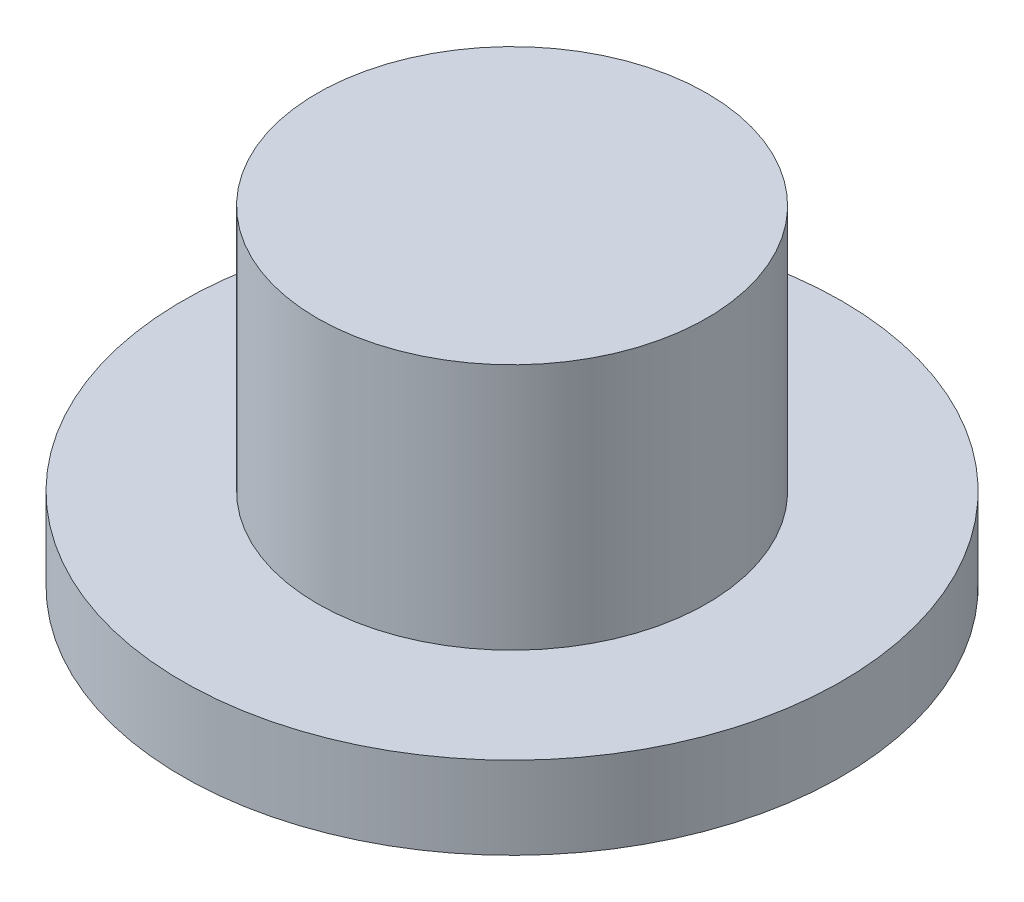
ISO-10303-21;
HEADER;
FILE_DESCRIPTION(('STEP AP214'),'2;1');
FILE_NAME('part.step','',(''),(''),'','','');
FILE_SCHEMA(('AUTOMOTIVE_DESIGN { 1 0 10303 214 1 1 1 1 }'));
ENDSEC;
DATA;
#1=APPLICATION_CONTEXT('core data for automotive mechanical design processes');
#2=APPLICATION_PROTOCOL_DEFINITION('international standard','automotive_design',2000,#1);
#3=PRODUCT_CONTEXT('',#1,'mechanical');
#4=PRODUCT('Part','Part','',(#3));
#5=PRODUCT_RELATED_PRODUCT_CATEGORY('part','',(#4));
#6=PRODUCT_DEFINITION_FORMATION('','',#4);
#7=PRODUCT_DEFINITION_CONTEXT('part definition',#1,'design');
#8=PRODUCT_DEFINITION('design','',#6,#7);
#9=PRODUCT_DEFINITION_SHAPE('','',#8);
#10=(LENGTH_UNIT() NAMED_UNIT(*) SI_UNIT(.MILLI.,.METRE.));
#11=(NAMED_UNIT(*) PLANE_ANGLE_UNIT() SI_UNIT($,.RADIAN.));
#12=(NAMED_UNIT(*) SI_UNIT($,.STERADIAN.) SOLID_ANGLE_UNIT());
#13=UNCERTAINTY_MEASURE_WITH_UNIT(LENGTH_MEASURE(1.E-05),#10,'distance_accuracy_value','');
#14=(GEOMETRIC_REPRESENTATION_CONTEXT(3) GLOBAL_UNCERTAINTY_ASSIGNED_CONTEXT((#13)) GLOBAL_UNIT_ASSIGNED_CONTEXT((#10,
#11,#12)) REPRESENTATION_CONTEXT('',''));
#15=CARTESIAN_POINT('',(0.,0.,0.));
#16=DIRECTION('',(0.,0.,1.));
#17=DIRECTION('',(1.,0.,0.));
#18=AXIS2_PLACEMENT_3D('',#15,#16,#17);
#19=CARTESIAN_POINT('',(0.,3.,0.));
#20=DIRECTION('',(0.,-1.,0.));
#21=DIRECTION('',(0.,0.,-1.));
#22=AXIS2_PLACEMENT_3D('',#19,#20,#21);
#23=CYLINDRICAL_SURFACE('',#22,2.365);
#24=CARTESIAN_POINT('',(0.,3.,0.));
#25=DIRECTION('',(0.,1.,0.));
#26=DIRECTION('',(0.,0.,1.));
#27=AXIS2_PLACEMENT_3D('',#24,#25,#26);
#28=CIRCLE('',#27,2.365);
#29=CARTESIAN_POINT('',(0.,3.,2.365));
#30=VERTEX_POINT('',#29);
#31=EDGE_CURVE('E10',#30,#30,#28,.T.);
#32=ORIENTED_EDGE('',*,*,#31,.F.);
#33=EDGE_LOOP('',(#32));
#34=FACE_BOUND('',#33,.T.);
#35=CARTESIAN_POINT('',(0.,0.,0.));
#36=DIRECTION('',(0.,1.,0.));
#37=DIRECTION('',(0.,0.,1.));
#38=AXIS2_PLACEMENT_3D('',#35,#36,#37);
#39=CIRCLE('',#38,2.365);
#40=CARTESIAN_POINT('',(0.,0.,2.365));
#41=VERTEX_POINT('',#40);
#42=EDGE_CURVE('E44',#41,#41,#39,.T.);
#43=ORIENTED_EDGE('',*,*,#42,.T.);
#44=EDGE_LOOP('',(#43));
#45=FACE_BOUND('',#44,.T.);
#46=ADVANCED_FACE('F41',(#34,#45),#23,.T.);
#47=CARTESIAN_POINT('',(0.,3.,0.));
#48=DIRECTION('',(0.,1.,0.));
#49=DIRECTION('',(0.,0.,1.));
#50=AXIS2_PLACEMENT_3D('',#47,#48,#49);
#51=PLANE('',#50);
#52=ORIENTED_EDGE('',*,*,#31,.T.);
#53=EDGE_LOOP('',(#52));
#54=FACE_BOUND('',#53,.T.);
#55=ADVANCED_FACE('F68',(#54),#51,.T.);
#56=CARTESIAN_POINT('',(0.,-1.,0.));
#57=DIRECTION('',(0.,1.,0.));
#58=DIRECTION('',(0.,0.,1.));
#59=AXIS2_PLACEMENT_3D('',#56,#57,#58);
#60=CYLINDRICAL_SURFACE('',#59,4.);
#61=CARTESIAN_POINT('',(0.,-1.,0.));
#62=DIRECTION('',(0.,-1.,0.));
#63=DIRECTION('',(0.,0.,-1.));
#64=AXIS2_PLACEMENT_3D('',#61,#62,#63);
#65=CIRCLE('',#64,4.);
#66=CARTESIAN_POINT('',(0.,-1.,-4.));
#67=VERTEX_POINT('',#66);
#68=EDGE_CURVE('E53',#67,#67,#65,.T.);
#69=ORIENTED_EDGE('',*,*,#68,.F.);
#70=EDGE_LOOP('',(#69));
#71=FACE_BOUND('',#70,.T.);
#72=CARTESIAN_POINT('',(0.,0.,0.));
#73=DIRECTION('',(0.,-1.,0.));
#74=DIRECTION('',(0.,0.,-1.));
#75=AXIS2_PLACEMENT_3D('',#72,#73,#74);
#76=CIRCLE('',#75,4.);
#77=CARTESIAN_POINT('',(0.,0.,-4.));
#78=VERTEX_POINT('',#77);
#79=EDGE_CURVE('E55',#78,#78,#76,.T.);
#80=ORIENTED_EDGE('',*,*,#79,.T.);
#81=EDGE_LOOP('',(#80));
#82=FACE_BOUND('',#81,.T.);
#83=ADVANCED_FACE('F65',(#71,#82),#60,.T.);
#84=CARTESIAN_POINT('',(0.,-1.,0.));
#85=DIRECTION('',(0.,-1.,0.));
#86=DIRECTION('',(0.,0.,-1.));
#87=AXIS2_PLACEMENT_3D('',#84,#85,#86);
#88=PLANE('',#87);
#89=ORIENTED_EDGE('',*,*,#68,.T.);
#90=EDGE_LOOP('',(#89));
#91=FACE_BOUND('',#90,.T.);
#92=ADVANCED_FACE('F63',(#91),#88,.T.);
#93=CARTESIAN_POINT('',(0.,0.,0.));
#94=DIRECTION('',(0.,-1.,0.));
#95=DIRECTION('',(0.,0.,-1.));
#96=AXIS2_PLACEMENT_3D('',#93,#94,#95);
#97=PLANE('',#96);
#98=ORIENTED_EDGE('',*,*,#42,.F.);
#99=EDGE_LOOP('',(#98));
#100=FACE_BOUND('',#99,.T.);
#101=ORIENTED_EDGE('',*,*,#79,.F.);
#102=EDGE_LOOP('',(#101));
#103=FACE_BOUND('',#102,.T.);
#104=ADVANCED_FACE('F72',(#100,#103),#97,.F.);
#105=CLOSED_SHELL('',(#46,#55,#83,#92,#104));
#106=MANIFOLD_SOLID_BREP('B2',#105);
#107=ADVANCED_BREP_SHAPE_REPRESENTATION('',(#18,#106),#14);
#108=SHAPE_DEFINITION_REPRESENTATION(#9,#107);
ENDSEC;
END-ISO-10303-21;
